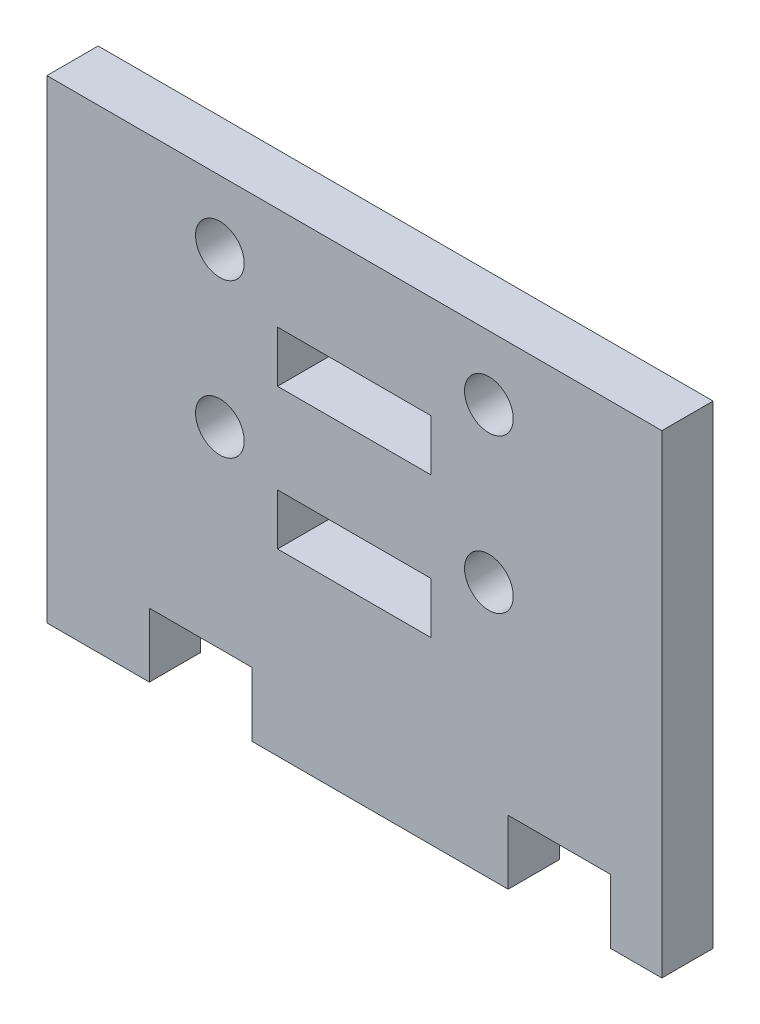
ISO-10303-21;
HEADER;
FILE_DESCRIPTION(('STEP AP214'),'2;1');
FILE_NAME('part.step','',(''),(''),'','','');
FILE_SCHEMA(('AUTOMOTIVE_DESIGN { 1 0 10303 214 1 1 1 1 }'));
ENDSEC;
DATA;
#1=APPLICATION_CONTEXT('core data for automotive mechanical design processes');
#2=APPLICATION_PROTOCOL_DEFINITION('international standard','automotive_design',2000,#1);
#3=PRODUCT_CONTEXT('',#1,'mechanical');
#4=PRODUCT('Part','Part','',(#3));
#5=PRODUCT_RELATED_PRODUCT_CATEGORY('part','',(#4));
#6=PRODUCT_DEFINITION_FORMATION('','',#4);
#7=PRODUCT_DEFINITION_CONTEXT('part definition',#1,'design');
#8=PRODUCT_DEFINITION('design','',#6,#7);
#9=PRODUCT_DEFINITION_SHAPE('','',#8);
#10=(LENGTH_UNIT() NAMED_UNIT(*) SI_UNIT(.MILLI.,.METRE.));
#11=(NAMED_UNIT(*) PLANE_ANGLE_UNIT() SI_UNIT($,.RADIAN.));
#12=(NAMED_UNIT(*) SI_UNIT($,.STERADIAN.) SOLID_ANGLE_UNIT());
#13=UNCERTAINTY_MEASURE_WITH_UNIT(LENGTH_MEASURE(1.E-05),#10,'distance_accuracy_value','');
#14=(GEOMETRIC_REPRESENTATION_CONTEXT(3) GLOBAL_UNCERTAINTY_ASSIGNED_CONTEXT((#13)) GLOBAL_UNIT_ASSIGNED_CONTEXT((#10,
#11,#12)) REPRESENTATION_CONTEXT('',''));
#15=CARTESIAN_POINT('',(0.,0.,0.));
#16=DIRECTION('',(0.,0.,1.));
#17=DIRECTION('',(1.,0.,0.));
#18=AXIS2_PLACEMENT_3D('',#15,#16,#17);
#19=CARTESIAN_POINT('',(0.,0.,2.));
#20=DIRECTION('',(0.,0.,-1.));
#21=DIRECTION('',(-1.,0.,0.));
#22=AXIS2_PLACEMENT_3D('',#19,#20,#21);
#23=PLANE('',#22);
#24=CARTESIAN_POINT('',(17.25,10.,2.));
#25=DIRECTION('',(0.,0.,1.));
#26=DIRECTION('',(-1.,0.,0.));
#27=AXIS2_PLACEMENT_3D('',#24,#25,#26);
#28=CIRCLE('',#27,0.950000000000001);
#29=CARTESIAN_POINT('',(16.3,10.,2.));
#30=VERTEX_POINT('',#29);
#31=EDGE_CURVE('E626',#30,#30,#28,.T.);
#32=ORIENTED_EDGE('',*,*,#31,.F.);
#33=EDGE_LOOP('',(#32));
#34=FACE_BOUND('',#33,.T.);
#35=DIRECTION('',(0.,-1.,0.));
#36=VECTOR('',#35,1.);
#37=CARTESIAN_POINT('',(9.00000000000001,9.,2.));
#38=LINE('',#37,#36);
#39=CARTESIAN_POINT('',(9.00000000000001,9.,2.));
#40=VERTEX_POINT('',#39);
#41=CARTESIAN_POINT('',(9.00000000000001,7.,2.));
#42=VERTEX_POINT('',#41);
#43=EDGE_CURVE('E169',#40,#42,#38,.T.);
#44=ORIENTED_EDGE('',*,*,#43,.F.);
#45=DIRECTION('',(-1.,0.,0.));
#46=VECTOR('',#45,1.);
#47=CARTESIAN_POINT('',(15.,9.,2.));
#48=LINE('',#47,#46);
#49=CARTESIAN_POINT('',(15.,9.,2.));
#50=VERTEX_POINT('',#49);
#51=EDGE_CURVE('E192',#50,#40,#48,.T.);
#52=ORIENTED_EDGE('',*,*,#51,.F.);
#53=DIRECTION('',(0.,1.,0.));
#54=VECTOR('',#53,1.);
#55=CARTESIAN_POINT('',(15.,7.,2.));
#56=LINE('',#55,#54);
#57=CARTESIAN_POINT('',(15.,7.,2.));
#58=VERTEX_POINT('',#57);
#59=EDGE_CURVE('E190',#58,#50,#56,.T.);
#60=ORIENTED_EDGE('',*,*,#59,.F.);
#61=DIRECTION('',(1.,0.,0.));
#62=VECTOR('',#61,1.);
#63=CARTESIAN_POINT('',(9.00000000000001,7.,2.));
#64=LINE('',#63,#62);
#65=EDGE_CURVE('E177',#42,#58,#64,.T.);
#66=ORIENTED_EDGE('',*,*,#65,.F.);
#67=EDGE_LOOP('',(#44,#52,#60,#66));
#68=FACE_BOUND('',#67,.T.);
#69=DIRECTION('',(1.,0.,0.));
#70=VECTOR('',#69,1.);
#71=CARTESIAN_POINT('',(9.00000000000001,12.5,2.));
#72=LINE('',#71,#70);
#73=CARTESIAN_POINT('',(9.00000000000001,12.5,2.));
#74=VERTEX_POINT('',#73);
#75=CARTESIAN_POINT('',(15.,12.5,2.));
#76=VERTEX_POINT('',#75);
#77=EDGE_CURVE('E214',#74,#76,#72,.T.);
#78=ORIENTED_EDGE('',*,*,#77,.F.);
#79=DIRECTION('',(0.,-1.,0.));
#80=VECTOR('',#79,1.);
#81=CARTESIAN_POINT('',(9.00000000000001,14.5,2.));
#82=LINE('',#81,#80);
#83=CARTESIAN_POINT('',(9.00000000000001,14.5,2.));
#84=VERTEX_POINT('',#83);
#85=EDGE_CURVE('E222',#84,#74,#82,.T.);
#86=ORIENTED_EDGE('',*,*,#85,.F.);
#87=DIRECTION('',(-1.,0.,0.));
#88=VECTOR('',#87,1.);
#89=CARTESIAN_POINT('',(15.,14.5,2.));
#90=LINE('',#89,#88);
#91=CARTESIAN_POINT('',(15.,14.5,2.));
#92=VERTEX_POINT('',#91);
#93=EDGE_CURVE('E219',#92,#84,#90,.T.);
#94=ORIENTED_EDGE('',*,*,#93,.F.);
#95=DIRECTION('',(0.,1.,0.));
#96=VECTOR('',#95,1.);
#97=CARTESIAN_POINT('',(15.,12.5,2.));
#98=LINE('',#97,#96);
#99=EDGE_CURVE('E216',#76,#92,#98,.T.);
#100=ORIENTED_EDGE('',*,*,#99,.F.);
#101=EDGE_LOOP('',(#78,#86,#94,#100));
#102=FACE_BOUND('',#101,.T.);
#103=DIRECTION('',(0.,-1.,0.));
#104=VECTOR('',#103,1.);
#105=CARTESIAN_POINT('',(0.,0.,2.));
#106=LINE('',#105,#104);
#107=CARTESIAN_POINT('',(0.,18.5,2.));
#108=VERTEX_POINT('',#107);
#109=CARTESIAN_POINT('',(0.,0.,2.));
#110=VERTEX_POINT('',#109);
#111=EDGE_CURVE('E245',#108,#110,#106,.T.);
#112=ORIENTED_EDGE('',*,*,#111,.T.);
#113=DIRECTION('',(1.,0.,0.));
#114=VECTOR('',#113,1.);
#115=CARTESIAN_POINT('',(4.,0.,2.));
#116=LINE('',#115,#114);
#117=CARTESIAN_POINT('',(4.,0.,2.));
#118=VERTEX_POINT('',#117);
#119=EDGE_CURVE('E248',#110,#118,#116,.T.);
#120=ORIENTED_EDGE('',*,*,#119,.T.);
#121=DIRECTION('',(0.,1.,0.));
#122=VECTOR('',#121,1.);
#123=CARTESIAN_POINT('',(4.,2.5,2.));
#124=LINE('',#123,#122);
#125=CARTESIAN_POINT('',(4.,2.5,2.));
#126=VERTEX_POINT('',#125);
#127=EDGE_CURVE('E251',#118,#126,#124,.T.);
#128=ORIENTED_EDGE('',*,*,#127,.T.);
#129=DIRECTION('',(1.,0.,0.));
#130=VECTOR('',#129,1.);
#131=CARTESIAN_POINT('',(4.,2.5,2.));
#132=LINE('',#131,#130);
#133=CARTESIAN_POINT('',(8.,2.5,2.));
#134=VERTEX_POINT('',#133);
#135=EDGE_CURVE('E253',#126,#134,#132,.T.);
#136=ORIENTED_EDGE('',*,*,#135,.T.);
#137=DIRECTION('',(0.,-1.,0.));
#138=VECTOR('',#137,1.);
#139=CARTESIAN_POINT('',(8.,0.,2.));
#140=LINE('',#139,#138);
#141=CARTESIAN_POINT('',(8.,0.,2.));
#142=VERTEX_POINT('',#141);
#143=EDGE_CURVE('E255',#134,#142,#140,.T.);
#144=ORIENTED_EDGE('',*,*,#143,.T.);
#145=DIRECTION('',(1.,0.,0.));
#146=VECTOR('',#145,1.);
#147=CARTESIAN_POINT('',(8.,0.,2.));
#148=LINE('',#147,#146);
#149=CARTESIAN_POINT('',(18.,0.,2.));
#150=VERTEX_POINT('',#149);
#151=EDGE_CURVE('E257',#142,#150,#148,.T.);
#152=ORIENTED_EDGE('',*,*,#151,.T.);
#153=DIRECTION('',(0.,1.,0.));
#154=VECTOR('',#153,1.);
#155=CARTESIAN_POINT('',(18.,0.,2.));
#156=LINE('',#155,#154);
#157=CARTESIAN_POINT('',(18.,2.5,2.));
#158=VERTEX_POINT('',#157);
#159=EDGE_CURVE('E259',#150,#158,#156,.T.);
#160=ORIENTED_EDGE('',*,*,#159,.T.);
#161=DIRECTION('',(1.,0.,0.));
#162=VECTOR('',#161,1.);
#163=CARTESIAN_POINT('',(18.,2.5,2.));
#164=LINE('',#163,#162);
#165=CARTESIAN_POINT('',(22.,2.5,2.));
#166=VERTEX_POINT('',#165);
#167=EDGE_CURVE('E261',#158,#166,#164,.T.);
#168=ORIENTED_EDGE('',*,*,#167,.T.);
#169=DIRECTION('',(0.,-1.,0.));
#170=VECTOR('',#169,1.);
#171=CARTESIAN_POINT('',(22.,2.5,2.));
#172=LINE('',#171,#170);
#173=CARTESIAN_POINT('',(22.,0.,2.));
#174=VERTEX_POINT('',#173);
#175=EDGE_CURVE('E263',#166,#174,#172,.T.);
#176=ORIENTED_EDGE('',*,*,#175,.T.);
#177=DIRECTION('',(1.,0.,0.));
#178=VECTOR('',#177,1.);
#179=CARTESIAN_POINT('',(22.,0.,2.));
#180=LINE('',#179,#178);
#181=CARTESIAN_POINT('',(24.,0.,2.));
#182=VERTEX_POINT('',#181);
#183=EDGE_CURVE('E265',#174,#182,#180,.T.);
#184=ORIENTED_EDGE('',*,*,#183,.T.);
#185=DIRECTION('',(0.,1.,0.));
#186=VECTOR('',#185,1.);
#187=CARTESIAN_POINT('',(24.,0.,2.));
#188=LINE('',#187,#186);
#189=CARTESIAN_POINT('',(24.,18.5,2.));
#190=VERTEX_POINT('',#189);
#191=EDGE_CURVE('E267',#182,#190,#188,.T.);
#192=ORIENTED_EDGE('',*,*,#191,.T.);
#193=DIRECTION('',(-1.,0.,0.));
#194=VECTOR('',#193,1.);
#195=CARTESIAN_POINT('',(0.,18.5,2.));
#196=LINE('',#195,#194);
#197=EDGE_CURVE('E269',#190,#108,#196,.T.);
#198=ORIENTED_EDGE('',*,*,#197,.T.);
#199=EDGE_LOOP('',(#112,#120,#128,#136,#144,#152,#160,#168,#176,#184,#192,#198));
#200=FACE_BOUND('',#199,.T.);
#201=CARTESIAN_POINT('',(6.75,16.,2.));
#202=DIRECTION('',(0.,0.,1.));
#203=DIRECTION('',(1.,0.,0.));
#204=AXIS2_PLACEMENT_3D('',#201,#202,#203);
#205=CIRCLE('',#204,0.95);
#206=CARTESIAN_POINT('',(7.7,16.,2.));
#207=VERTEX_POINT('',#206);
#208=EDGE_CURVE('E208',#207,#207,#205,.T.);
#209=ORIENTED_EDGE('',*,*,#208,.F.);
#210=EDGE_LOOP('',(#209));
#211=FACE_BOUND('',#210,.T.);
#212=CARTESIAN_POINT('',(6.75,9.99999999999999,2.));
#213=DIRECTION('',(0.,0.,1.));
#214=DIRECTION('',(1.,0.,0.));
#215=AXIS2_PLACEMENT_3D('',#212,#213,#214);
#216=CIRCLE('',#215,0.95);
#217=CARTESIAN_POINT('',(7.7,9.99999999999999,2.));
#218=VERTEX_POINT('',#217);
#219=EDGE_CURVE('E198',#218,#218,#216,.T.);
#220=ORIENTED_EDGE('',*,*,#219,.F.);
#221=EDGE_LOOP('',(#220));
#222=FACE_BOUND('',#221,.T.);
#223=CARTESIAN_POINT('',(17.25,16.,2.));
#224=DIRECTION('',(0.,0.,1.));
#225=DIRECTION('',(-1.,0.,0.));
#226=AXIS2_PLACEMENT_3D('',#223,#224,#225);
#227=CIRCLE('',#226,0.950000000000001);
#228=CARTESIAN_POINT('',(16.3,16.,2.));
#229=VERTEX_POINT('',#228);
#230=EDGE_CURVE('E617',#229,#229,#227,.T.);
#231=ORIENTED_EDGE('',*,*,#230,.F.);
#232=EDGE_LOOP('',(#231));
#233=FACE_BOUND('',#232,.T.);
#234=ADVANCED_FACE('F32',(#34,#68,#102,#200,#211,#222,#233),#23,.F.);
#235=CARTESIAN_POINT('',(0.,0.,0.));
#236=DIRECTION('',(0.,0.,-1.));
#237=DIRECTION('',(-1.,0.,0.));
#238=AXIS2_PLACEMENT_3D('',#235,#236,#237);
#239=PLANE('',#238);
#240=CARTESIAN_POINT('',(17.25,10.,0.));
#241=DIRECTION('',(0.,0.,1.));
#242=DIRECTION('',(-1.,0.,0.));
#243=AXIS2_PLACEMENT_3D('',#240,#241,#242);
#244=CIRCLE('',#243,0.950000000000001);
#245=CARTESIAN_POINT('',(16.3,10.,0.));
#246=VERTEX_POINT('',#245);
#247=EDGE_CURVE('E623',#246,#246,#244,.T.);
#248=ORIENTED_EDGE('',*,*,#247,.T.);
#249=EDGE_LOOP('',(#248));
#250=FACE_BOUND('',#249,.T.);
#251=DIRECTION('',(-1.,0.,0.));
#252=VECTOR('',#251,1.);
#253=CARTESIAN_POINT('',(15.,9.,0.));
#254=LINE('',#253,#252);
#255=CARTESIAN_POINT('',(15.,9.,0.));
#256=VERTEX_POINT('',#255);
#257=CARTESIAN_POINT('',(9.00000000000001,9.,0.));
#258=VERTEX_POINT('',#257);
#259=EDGE_CURVE('E178',#256,#258,#254,.T.);
#260=ORIENTED_EDGE('',*,*,#259,.T.);
#261=DIRECTION('',(0.,-1.,0.));
#262=VECTOR('',#261,1.);
#263=CARTESIAN_POINT('',(9.00000000000001,9.,0.));
#264=LINE('',#263,#262);
#265=CARTESIAN_POINT('',(9.00000000000001,7.,0.));
#266=VERTEX_POINT('',#265);
#267=EDGE_CURVE('E55',#258,#266,#264,.T.);
#268=ORIENTED_EDGE('',*,*,#267,.T.);
#269=DIRECTION('',(1.,0.,0.));
#270=VECTOR('',#269,1.);
#271=CARTESIAN_POINT('',(9.00000000000001,7.,0.));
#272=LINE('',#271,#270);
#273=CARTESIAN_POINT('',(15.,7.,0.));
#274=VERTEX_POINT('',#273);
#275=EDGE_CURVE('E184',#266,#274,#272,.T.);
#276=ORIENTED_EDGE('',*,*,#275,.T.);
#277=DIRECTION('',(0.,1.,0.));
#278=VECTOR('',#277,1.);
#279=CARTESIAN_POINT('',(15.,7.,0.));
#280=LINE('',#279,#278);
#281=EDGE_CURVE('E200',#274,#256,#280,.T.);
#282=ORIENTED_EDGE('',*,*,#281,.T.);
#283=EDGE_LOOP('',(#260,#268,#276,#282));
#284=FACE_BOUND('',#283,.T.);
#285=DIRECTION('',(0.,-1.,0.));
#286=VECTOR('',#285,1.);
#287=CARTESIAN_POINT('',(9.00000000000001,14.5,0.));
#288=LINE('',#287,#286);
#289=CARTESIAN_POINT('',(9.00000000000001,14.5,0.));
#290=VERTEX_POINT('',#289);
#291=CARTESIAN_POINT('',(9.00000000000001,12.5,0.));
#292=VERTEX_POINT('',#291);
#293=EDGE_CURVE('E217',#290,#292,#288,.T.);
#294=ORIENTED_EDGE('',*,*,#293,.T.);
#295=DIRECTION('',(1.,0.,0.));
#296=VECTOR('',#295,1.);
#297=CARTESIAN_POINT('',(9.00000000000001,12.5,0.));
#298=LINE('',#297,#296);
#299=CARTESIAN_POINT('',(15.,12.5,0.));
#300=VERTEX_POINT('',#299);
#301=EDGE_CURVE('E211',#292,#300,#298,.T.);
#302=ORIENTED_EDGE('',*,*,#301,.T.);
#303=DIRECTION('',(0.,1.,0.));
#304=VECTOR('',#303,1.);
#305=CARTESIAN_POINT('',(15.,12.5,0.));
#306=LINE('',#305,#304);
#307=CARTESIAN_POINT('',(15.,14.5,0.));
#308=VERTEX_POINT('',#307);
#309=EDGE_CURVE('E227',#300,#308,#306,.T.);
#310=ORIENTED_EDGE('',*,*,#309,.T.);
#311=DIRECTION('',(-1.,0.,0.));
#312=VECTOR('',#311,1.);
#313=CARTESIAN_POINT('',(15.,14.5,0.));
#314=LINE('',#313,#312);
#315=EDGE_CURVE('E230',#308,#290,#314,.T.);
#316=ORIENTED_EDGE('',*,*,#315,.T.);
#317=EDGE_LOOP('',(#294,#302,#310,#316));
#318=FACE_BOUND('',#317,.T.);
#319=DIRECTION('',(0.,-1.,0.));
#320=VECTOR('',#319,1.);
#321=CARTESIAN_POINT('',(0.,0.,0.));
#322=LINE('',#321,#320);
#323=CARTESIAN_POINT('',(0.,18.5,0.));
#324=VERTEX_POINT('',#323);
#325=CARTESIAN_POINT('',(0.,0.,0.));
#326=VERTEX_POINT('',#325);
#327=EDGE_CURVE('E244',#324,#326,#322,.T.);
#328=ORIENTED_EDGE('',*,*,#327,.F.);
#329=DIRECTION('',(-1.,0.,0.));
#330=VECTOR('',#329,1.);
#331=CARTESIAN_POINT('',(0.,18.5,0.));
#332=LINE('',#331,#330);
#333=CARTESIAN_POINT('',(24.,18.5,0.));
#334=VERTEX_POINT('',#333);
#335=EDGE_CURVE('E249',#334,#324,#332,.T.);
#336=ORIENTED_EDGE('',*,*,#335,.F.);
#337=DIRECTION('',(0.,1.,0.));
#338=VECTOR('',#337,1.);
#339=CARTESIAN_POINT('',(24.,0.,0.));
#340=LINE('',#339,#338);
#341=CARTESIAN_POINT('',(24.,0.,0.));
#342=VERTEX_POINT('',#341);
#343=EDGE_CURVE('E292',#342,#334,#340,.T.);
#344=ORIENTED_EDGE('',*,*,#343,.F.);
#345=DIRECTION('',(1.,0.,0.));
#346=VECTOR('',#345,1.);
#347=CARTESIAN_POINT('',(22.,0.,0.));
#348=LINE('',#347,#346);
#349=CARTESIAN_POINT('',(22.,0.,0.));
#350=VERTEX_POINT('',#349);
#351=EDGE_CURVE('E290',#350,#342,#348,.T.);
#352=ORIENTED_EDGE('',*,*,#351,.F.);
#353=DIRECTION('',(0.,-1.,0.));
#354=VECTOR('',#353,1.);
#355=CARTESIAN_POINT('',(22.,2.5,0.));
#356=LINE('',#355,#354);
#357=CARTESIAN_POINT('',(22.,2.5,0.));
#358=VERTEX_POINT('',#357);
#359=EDGE_CURVE('E288',#358,#350,#356,.T.);
#360=ORIENTED_EDGE('',*,*,#359,.F.);
#361=DIRECTION('',(1.,0.,0.));
#362=VECTOR('',#361,1.);
#363=CARTESIAN_POINT('',(18.,2.5,0.));
#364=LINE('',#363,#362);
#365=CARTESIAN_POINT('',(18.,2.5,0.));
#366=VERTEX_POINT('',#365);
#367=EDGE_CURVE('E286',#366,#358,#364,.T.);
#368=ORIENTED_EDGE('',*,*,#367,.F.);
#369=DIRECTION('',(0.,1.,0.));
#370=VECTOR('',#369,1.);
#371=CARTESIAN_POINT('',(18.,0.,0.));
#372=LINE('',#371,#370);
#373=CARTESIAN_POINT('',(18.,0.,0.));
#374=VERTEX_POINT('',#373);
#375=EDGE_CURVE('E284',#374,#366,#372,.T.);
#376=ORIENTED_EDGE('',*,*,#375,.F.);
#377=DIRECTION('',(1.,0.,0.));
#378=VECTOR('',#377,1.);
#379=CARTESIAN_POINT('',(8.,0.,0.));
#380=LINE('',#379,#378);
#381=CARTESIAN_POINT('',(8.,0.,0.));
#382=VERTEX_POINT('',#381);
#383=EDGE_CURVE('E282',#382,#374,#380,.T.);
#384=ORIENTED_EDGE('',*,*,#383,.F.);
#385=DIRECTION('',(0.,-1.,0.));
#386=VECTOR('',#385,1.);
#387=CARTESIAN_POINT('',(8.,0.,0.));
#388=LINE('',#387,#386);
#389=CARTESIAN_POINT('',(8.,2.5,0.));
#390=VERTEX_POINT('',#389);
#391=EDGE_CURVE('E280',#390,#382,#388,.T.);
#392=ORIENTED_EDGE('',*,*,#391,.F.);
#393=DIRECTION('',(1.,0.,0.));
#394=VECTOR('',#393,1.);
#395=CARTESIAN_POINT('',(4.,2.5,0.));
#396=LINE('',#395,#394);
#397=CARTESIAN_POINT('',(4.,2.5,0.));
#398=VERTEX_POINT('',#397);
#399=EDGE_CURVE('E278',#398,#390,#396,.T.);
#400=ORIENTED_EDGE('',*,*,#399,.F.);
#401=DIRECTION('',(0.,1.,0.));
#402=VECTOR('',#401,1.);
#403=CARTESIAN_POINT('',(4.,2.5,0.));
#404=LINE('',#403,#402);
#405=CARTESIAN_POINT('',(4.,0.,0.));
#406=VERTEX_POINT('',#405);
#407=EDGE_CURVE('E276',#406,#398,#404,.T.);
#408=ORIENTED_EDGE('',*,*,#407,.F.);
#409=DIRECTION('',(1.,0.,0.));
#410=VECTOR('',#409,1.);
#411=CARTESIAN_POINT('',(4.,0.,0.));
#412=LINE('',#411,#410);
#413=EDGE_CURVE('E274',#326,#406,#412,.T.);
#414=ORIENTED_EDGE('',*,*,#413,.F.);
#415=EDGE_LOOP('',(#328,#336,#344,#352,#360,#368,#376,#384,#392,#400,#408,#414));
#416=FACE_BOUND('',#415,.T.);
#417=CARTESIAN_POINT('',(6.75,16.,0.));
#418=DIRECTION('',(0.,0.,1.));
#419=DIRECTION('',(1.,0.,0.));
#420=AXIS2_PLACEMENT_3D('',#417,#418,#419);
#421=CIRCLE('',#420,0.95);
#422=CARTESIAN_POINT('',(7.7,16.,0.));
#423=VERTEX_POINT('',#422);
#424=EDGE_CURVE('E185',#423,#423,#421,.T.);
#425=ORIENTED_EDGE('',*,*,#424,.T.);
#426=EDGE_LOOP('',(#425));
#427=FACE_BOUND('',#426,.T.);
#428=CARTESIAN_POINT('',(6.75,9.99999999999999,0.));
#429=DIRECTION('',(0.,0.,1.));
#430=DIRECTION('',(1.,0.,0.));
#431=AXIS2_PLACEMENT_3D('',#428,#429,#430);
#432=CIRCLE('',#431,0.95);
#433=CARTESIAN_POINT('',(7.7,9.99999999999999,0.));
#434=VERTEX_POINT('',#433);
#435=EDGE_CURVE('E629',#434,#434,#432,.T.);
#436=ORIENTED_EDGE('',*,*,#435,.T.);
#437=EDGE_LOOP('',(#436));
#438=FACE_BOUND('',#437,.T.);
#439=CARTESIAN_POINT('',(17.25,16.,0.));
#440=DIRECTION('',(0.,0.,1.));
#441=DIRECTION('',(-1.,0.,0.));
#442=AXIS2_PLACEMENT_3D('',#439,#440,#441);
#443=CIRCLE('',#442,0.950000000000001);
#444=CARTESIAN_POINT('',(16.3,16.,0.));
#445=VERTEX_POINT('',#444);
#446=EDGE_CURVE('E620',#445,#445,#443,.T.);
#447=ORIENTED_EDGE('',*,*,#446,.T.);
#448=EDGE_LOOP('',(#447));
#449=FACE_BOUND('',#448,.T.);
#450=ADVANCED_FACE('F334',(#250,#284,#318,#416,#427,#438,#449),#239,.T.);
#451=CARTESIAN_POINT('',(0.,0.,2.));
#452=DIRECTION('',(1.,0.,0.));
#453=DIRECTION('',(0.,0.,-1.));
#454=AXIS2_PLACEMENT_3D('',#451,#452,#453);
#455=PLANE('',#454);
#456=ORIENTED_EDGE('',*,*,#327,.T.);
#457=DIRECTION('',(0.,0.,-1.));
#458=VECTOR('',#457,1.);
#459=CARTESIAN_POINT('',(0.,0.,2.));
#460=LINE('',#459,#458);
#461=EDGE_CURVE('E11',#110,#326,#460,.T.);
#462=ORIENTED_EDGE('',*,*,#461,.F.);
#463=ORIENTED_EDGE('',*,*,#111,.F.);
#464=DIRECTION('',(0.,0.,-1.));
#465=VECTOR('',#464,1.);
#466=CARTESIAN_POINT('',(0.,18.5,2.));
#467=LINE('',#466,#465);
#468=EDGE_CURVE('E271',#108,#324,#467,.T.);
#469=ORIENTED_EDGE('',*,*,#468,.T.);
#470=EDGE_LOOP('',(#456,#462,#463,#469));
#471=FACE_BOUND('',#470,.T.);
#472=ADVANCED_FACE('F34',(#471),#455,.F.);
#473=CARTESIAN_POINT('',(4.,0.,2.));
#474=DIRECTION('',(0.,1.,0.));
#475=DIRECTION('',(-1.,0.,0.));
#476=AXIS2_PLACEMENT_3D('',#473,#474,#475);
#477=PLANE('',#476);
#478=ORIENTED_EDGE('',*,*,#413,.T.);
#479=DIRECTION('',(0.,0.,-1.));
#480=VECTOR('',#479,1.);
#481=CARTESIAN_POINT('',(4.,0.,2.));
#482=LINE('',#481,#480);
#483=EDGE_CURVE('E40',#118,#406,#482,.T.);
#484=ORIENTED_EDGE('',*,*,#483,.F.);
#485=ORIENTED_EDGE('',*,*,#119,.F.);
#486=ORIENTED_EDGE('',*,*,#461,.T.);
#487=EDGE_LOOP('',(#478,#484,#485,#486));
#488=FACE_BOUND('',#487,.T.);
#489=ADVANCED_FACE('F352',(#488),#477,.F.);
#490=CARTESIAN_POINT('',(4.,2.5,2.));
#491=DIRECTION('',(-1.,0.,0.));
#492=DIRECTION('',(0.,-1.,0.));
#493=AXIS2_PLACEMENT_3D('',#490,#491,#492);
#494=PLANE('',#493);
#495=ORIENTED_EDGE('',*,*,#407,.T.);
#496=DIRECTION('',(0.,0.,-1.));
#497=VECTOR('',#496,1.);
#498=CARTESIAN_POINT('',(4.,2.5,2.));
#499=LINE('',#498,#497);
#500=EDGE_CURVE('E321',#126,#398,#499,.T.);
#501=ORIENTED_EDGE('',*,*,#500,.F.);
#502=ORIENTED_EDGE('',*,*,#127,.F.);
#503=ORIENTED_EDGE('',*,*,#483,.T.);
#504=EDGE_LOOP('',(#495,#501,#502,#503));
#505=FACE_BOUND('',#504,.T.);
#506=ADVANCED_FACE('F328',(#505),#494,.F.);
#507=CARTESIAN_POINT('',(4.,2.5,2.));
#508=DIRECTION('',(0.,1.,0.));
#509=DIRECTION('',(-1.,0.,0.));
#510=AXIS2_PLACEMENT_3D('',#507,#508,#509);
#511=PLANE('',#510);
#512=ORIENTED_EDGE('',*,*,#399,.T.);
#513=DIRECTION('',(0.,0.,-1.));
#514=VECTOR('',#513,1.);
#515=CARTESIAN_POINT('',(8.,2.5,2.));
#516=LINE('',#515,#514);
#517=EDGE_CURVE('E318',#134,#390,#516,.T.);
#518=ORIENTED_EDGE('',*,*,#517,.F.);
#519=ORIENTED_EDGE('',*,*,#135,.F.);
#520=ORIENTED_EDGE('',*,*,#500,.T.);
#521=EDGE_LOOP('',(#512,#518,#519,#520));
#522=FACE_BOUND('',#521,.T.);
#523=ADVANCED_FACE('F340',(#522),#511,.F.);
#524=CARTESIAN_POINT('',(8.,0.,2.));
#525=DIRECTION('',(1.,0.,0.));
#526=DIRECTION('',(0.,0.,-1.));
#527=AXIS2_PLACEMENT_3D('',#524,#525,#526);
#528=PLANE('',#527);
#529=ORIENTED_EDGE('',*,*,#391,.T.);
#530=DIRECTION('',(0.,0.,-1.));
#531=VECTOR('',#530,1.);
#532=CARTESIAN_POINT('',(8.,0.,2.));
#533=LINE('',#532,#531);
#534=EDGE_CURVE('E315',#142,#382,#533,.T.);
#535=ORIENTED_EDGE('',*,*,#534,.F.);
#536=ORIENTED_EDGE('',*,*,#143,.F.);
#537=ORIENTED_EDGE('',*,*,#517,.T.);
#538=EDGE_LOOP('',(#529,#535,#536,#537));
#539=FACE_BOUND('',#538,.T.);
#540=ADVANCED_FACE('F344',(#539),#528,.F.);
#541=CARTESIAN_POINT('',(8.,0.,2.));
#542=DIRECTION('',(0.,1.,0.));
#543=DIRECTION('',(-1.,0.,0.));
#544=AXIS2_PLACEMENT_3D('',#541,#542,#543);
#545=PLANE('',#544);
#546=ORIENTED_EDGE('',*,*,#383,.T.);
#547=DIRECTION('',(0.,0.,-1.));
#548=VECTOR('',#547,1.);
#549=CARTESIAN_POINT('',(18.,0.,2.));
#550=LINE('',#549,#548);
#551=EDGE_CURVE('E312',#150,#374,#550,.T.);
#552=ORIENTED_EDGE('',*,*,#551,.F.);
#553=ORIENTED_EDGE('',*,*,#151,.F.);
#554=ORIENTED_EDGE('',*,*,#534,.T.);
#555=EDGE_LOOP('',(#546,#552,#553,#554));
#556=FACE_BOUND('',#555,.T.);
#557=ADVANCED_FACE('F385',(#556),#545,.F.);
#558=CARTESIAN_POINT('',(18.,0.,2.));
#559=DIRECTION('',(-1.,0.,0.));
#560=DIRECTION('',(0.,0.,1.));
#561=AXIS2_PLACEMENT_3D('',#558,#559,#560);
#562=PLANE('',#561);
#563=ORIENTED_EDGE('',*,*,#375,.T.);
#564=DIRECTION('',(0.,0.,-1.));
#565=VECTOR('',#564,1.);
#566=CARTESIAN_POINT('',(18.,2.5,2.));
#567=LINE('',#566,#565);
#568=EDGE_CURVE('E309',#158,#366,#567,.T.);
#569=ORIENTED_EDGE('',*,*,#568,.F.);
#570=ORIENTED_EDGE('',*,*,#159,.F.);
#571=ORIENTED_EDGE('',*,*,#551,.T.);
#572=EDGE_LOOP('',(#563,#569,#570,#571));
#573=FACE_BOUND('',#572,.T.);
#574=ADVANCED_FACE('F383',(#573),#562,.F.);
#575=CARTESIAN_POINT('',(18.,2.5,2.));
#576=DIRECTION('',(0.,1.,0.));
#577=DIRECTION('',(-1.,0.,0.));
#578=AXIS2_PLACEMENT_3D('',#575,#576,#577);
#579=PLANE('',#578);
#580=ORIENTED_EDGE('',*,*,#367,.T.);
#581=DIRECTION('',(0.,0.,-1.));
#582=VECTOR('',#581,1.);
#583=CARTESIAN_POINT('',(22.,2.5,2.));
#584=LINE('',#583,#582);
#585=EDGE_CURVE('E306',#166,#358,#584,.T.);
#586=ORIENTED_EDGE('',*,*,#585,.F.);
#587=ORIENTED_EDGE('',*,*,#167,.F.);
#588=ORIENTED_EDGE('',*,*,#568,.T.);
#589=EDGE_LOOP('',(#580,#586,#587,#588));
#590=FACE_BOUND('',#589,.T.);
#591=ADVANCED_FACE('F379',(#590),#579,.F.);
#592=CARTESIAN_POINT('',(22.,2.5,2.));
#593=DIRECTION('',(1.,0.,0.));
#594=DIRECTION('',(0.,1.,0.));
#595=AXIS2_PLACEMENT_3D('',#592,#593,#594);
#596=PLANE('',#595);
#597=ORIENTED_EDGE('',*,*,#359,.T.);
#598=DIRECTION('',(0.,0.,-1.));
#599=VECTOR('',#598,1.);
#600=CARTESIAN_POINT('',(22.,0.,2.));
#601=LINE('',#600,#599);
#602=EDGE_CURVE('E303',#174,#350,#601,.T.);
#603=ORIENTED_EDGE('',*,*,#602,.F.);
#604=ORIENTED_EDGE('',*,*,#175,.F.);
#605=ORIENTED_EDGE('',*,*,#585,.T.);
#606=EDGE_LOOP('',(#597,#603,#604,#605));
#607=FACE_BOUND('',#606,.T.);
#608=ADVANCED_FACE('F374',(#607),#596,.F.);
#609=CARTESIAN_POINT('',(22.,0.,2.));
#610=DIRECTION('',(0.,1.,0.));
#611=DIRECTION('',(0.,0.,1.));
#612=AXIS2_PLACEMENT_3D('',#609,#610,#611);
#613=PLANE('',#612);
#614=ORIENTED_EDGE('',*,*,#351,.T.);
#615=DIRECTION('',(0.,0.,-1.));
#616=VECTOR('',#615,1.);
#617=CARTESIAN_POINT('',(24.,0.,2.));
#618=LINE('',#617,#616);
#619=EDGE_CURVE('E300',#182,#342,#618,.T.);
#620=ORIENTED_EDGE('',*,*,#619,.F.);
#621=ORIENTED_EDGE('',*,*,#183,.F.);
#622=ORIENTED_EDGE('',*,*,#602,.T.);
#623=EDGE_LOOP('',(#614,#620,#621,#622));
#624=FACE_BOUND('',#623,.T.);
#625=ADVANCED_FACE('F368',(#624),#613,.F.);
#626=CARTESIAN_POINT('',(24.,0.,2.));
#627=DIRECTION('',(-1.,0.,0.));
#628=DIRECTION('',(0.,0.,1.));
#629=AXIS2_PLACEMENT_3D('',#626,#627,#628);
#630=PLANE('',#629);
#631=ORIENTED_EDGE('',*,*,#343,.T.);
#632=DIRECTION('',(0.,0.,-1.));
#633=VECTOR('',#632,1.);
#634=CARTESIAN_POINT('',(24.,18.5,2.));
#635=LINE('',#634,#633);
#636=EDGE_CURVE('E297',#190,#334,#635,.T.);
#637=ORIENTED_EDGE('',*,*,#636,.F.);
#638=ORIENTED_EDGE('',*,*,#191,.F.);
#639=ORIENTED_EDGE('',*,*,#619,.T.);
#640=EDGE_LOOP('',(#631,#637,#638,#639));
#641=FACE_BOUND('',#640,.T.);
#642=ADVANCED_FACE('F364',(#641),#630,.F.);
#643=CARTESIAN_POINT('',(0.,18.5,2.));
#644=DIRECTION('',(0.,-1.,0.));
#645=DIRECTION('',(0.,0.,-1.));
#646=AXIS2_PLACEMENT_3D('',#643,#644,#645);
#647=PLANE('',#646);
#648=ORIENTED_EDGE('',*,*,#335,.T.);
#649=ORIENTED_EDGE('',*,*,#468,.F.);
#650=ORIENTED_EDGE('',*,*,#197,.F.);
#651=ORIENTED_EDGE('',*,*,#636,.T.);
#652=EDGE_LOOP('',(#648,#649,#650,#651));
#653=FACE_BOUND('',#652,.T.);
#654=ADVANCED_FACE('F359',(#653),#647,.F.);
#655=CARTESIAN_POINT('',(9.00000000000001,12.5,2.));
#656=DIRECTION('',(0.,1.,0.));
#657=DIRECTION('',(0.,0.,1.));
#658=AXIS2_PLACEMENT_3D('',#655,#656,#657);
#659=PLANE('',#658);
#660=ORIENTED_EDGE('',*,*,#301,.F.);
#661=DIRECTION('',(0.,0.,-1.));
#662=VECTOR('',#661,1.);
#663=CARTESIAN_POINT('',(9.00000000000001,12.5,2.));
#664=LINE('',#663,#662);
#665=EDGE_CURVE('E224',#74,#292,#664,.T.);
#666=ORIENTED_EDGE('',*,*,#665,.F.);
#667=ORIENTED_EDGE('',*,*,#77,.T.);
#668=DIRECTION('',(0.,0.,-1.));
#669=VECTOR('',#668,1.);
#670=CARTESIAN_POINT('',(15.,12.5,2.));
#671=LINE('',#670,#669);
#672=EDGE_CURVE('E241',#76,#300,#671,.T.);
#673=ORIENTED_EDGE('',*,*,#672,.T.);
#674=EDGE_LOOP('',(#660,#666,#667,#673));
#675=FACE_BOUND('',#674,.T.);
#676=ADVANCED_FACE('F404',(#675),#659,.T.);
#677=CARTESIAN_POINT('',(15.,12.5,2.));
#678=DIRECTION('',(-1.,0.,0.));
#679=DIRECTION('',(0.,0.,1.));
#680=AXIS2_PLACEMENT_3D('',#677,#678,#679);
#681=PLANE('',#680);
#682=ORIENTED_EDGE('',*,*,#309,.F.);
#683=ORIENTED_EDGE('',*,*,#672,.F.);
#684=ORIENTED_EDGE('',*,*,#99,.T.);
#685=DIRECTION('',(0.,0.,-1.));
#686=VECTOR('',#685,1.);
#687=CARTESIAN_POINT('',(15.,14.5,2.));
#688=LINE('',#687,#686);
#689=EDGE_CURVE('E239',#92,#308,#688,.T.);
#690=ORIENTED_EDGE('',*,*,#689,.T.);
#691=EDGE_LOOP('',(#682,#683,#684,#690));
#692=FACE_BOUND('',#691,.T.);
#693=ADVANCED_FACE('F442',(#692),#681,.T.);
#694=CARTESIAN_POINT('',(15.,14.5,2.));
#695=DIRECTION('',(0.,-1.,0.));
#696=DIRECTION('',(0.,0.,-1.));
#697=AXIS2_PLACEMENT_3D('',#694,#695,#696);
#698=PLANE('',#697);
#699=ORIENTED_EDGE('',*,*,#315,.F.);
#700=ORIENTED_EDGE('',*,*,#689,.F.);
#701=ORIENTED_EDGE('',*,*,#93,.T.);
#702=DIRECTION('',(0.,0.,-1.));
#703=VECTOR('',#702,1.);
#704=CARTESIAN_POINT('',(9.00000000000001,14.5,2.));
#705=LINE('',#704,#703);
#706=EDGE_CURVE('E237',#84,#290,#705,.T.);
#707=ORIENTED_EDGE('',*,*,#706,.T.);
#708=EDGE_LOOP('',(#699,#700,#701,#707));
#709=FACE_BOUND('',#708,.T.);
#710=ADVANCED_FACE('F449',(#709),#698,.T.);
#711=CARTESIAN_POINT('',(9.00000000000001,14.5,2.));
#712=DIRECTION('',(1.,0.,0.));
#713=DIRECTION('',(0.,0.,-1.));
#714=AXIS2_PLACEMENT_3D('',#711,#712,#713);
#715=PLANE('',#714);
#716=ORIENTED_EDGE('',*,*,#293,.F.);
#717=ORIENTED_EDGE('',*,*,#706,.F.);
#718=ORIENTED_EDGE('',*,*,#85,.T.);
#719=ORIENTED_EDGE('',*,*,#665,.T.);
#720=EDGE_LOOP('',(#716,#717,#718,#719));
#721=FACE_BOUND('',#720,.T.);
#722=ADVANCED_FACE('F456',(#721),#715,.T.);
#723=CARTESIAN_POINT('',(6.75,16.,2.));
#724=DIRECTION('',(0.,0.,-1.));
#725=DIRECTION('',(-1.,0.,0.));
#726=AXIS2_PLACEMENT_3D('',#723,#724,#725);
#727=CYLINDRICAL_SURFACE('',#726,0.95);
#728=ORIENTED_EDGE('',*,*,#208,.T.);
#729=EDGE_LOOP('',(#728));
#730=FACE_BOUND('',#729,.T.);
#731=ORIENTED_EDGE('',*,*,#424,.F.);
#732=EDGE_LOOP('',(#731));
#733=FACE_BOUND('',#732,.T.);
#734=ADVANCED_FACE('F464',(#730,#733),#727,.F.);
#735=CARTESIAN_POINT('',(9.00000000000001,9.,2.));
#736=DIRECTION('',(1.,0.,0.));
#737=DIRECTION('',(0.,0.,-1.));
#738=AXIS2_PLACEMENT_3D('',#735,#736,#737);
#739=PLANE('',#738);
#740=ORIENTED_EDGE('',*,*,#267,.F.);
#741=DIRECTION('',(0.,0.,-1.));
#742=VECTOR('',#741,1.);
#743=CARTESIAN_POINT('',(9.00000000000001,9.,2.));
#744=LINE('',#743,#742);
#745=EDGE_CURVE('E173',#40,#258,#744,.T.);
#746=ORIENTED_EDGE('',*,*,#745,.F.);
#747=ORIENTED_EDGE('',*,*,#43,.T.);
#748=DIRECTION('',(0.,0.,-1.));
#749=VECTOR('',#748,1.);
#750=CARTESIAN_POINT('',(9.00000000000001,7.,2.));
#751=LINE('',#750,#749);
#752=EDGE_CURVE('E172',#42,#266,#751,.T.);
#753=ORIENTED_EDGE('',*,*,#752,.T.);
#754=EDGE_LOOP('',(#740,#746,#747,#753));
#755=FACE_BOUND('',#754,.T.);
#756=ADVANCED_FACE('F171',(#755),#739,.T.);
#757=CARTESIAN_POINT('',(9.00000000000001,7.,2.));
#758=DIRECTION('',(0.,1.,0.));
#759=DIRECTION('',(0.,0.,1.));
#760=AXIS2_PLACEMENT_3D('',#757,#758,#759);
#761=PLANE('',#760);
#762=ORIENTED_EDGE('',*,*,#275,.F.);
#763=ORIENTED_EDGE('',*,*,#752,.F.);
#764=ORIENTED_EDGE('',*,*,#65,.T.);
#765=DIRECTION('',(0.,0.,-1.));
#766=VECTOR('',#765,1.);
#767=CARTESIAN_POINT('',(15.,7.,2.));
#768=LINE('',#767,#766);
#769=EDGE_CURVE('E186',#58,#274,#768,.T.);
#770=ORIENTED_EDGE('',*,*,#769,.T.);
#771=EDGE_LOOP('',(#762,#763,#764,#770));
#772=FACE_BOUND('',#771,.T.);
#773=ADVANCED_FACE('F181',(#772),#761,.T.);
#774=CARTESIAN_POINT('',(15.,7.,2.));
#775=DIRECTION('',(-1.,0.,0.));
#776=DIRECTION('',(0.,0.,1.));
#777=AXIS2_PLACEMENT_3D('',#774,#775,#776);
#778=PLANE('',#777);
#779=ORIENTED_EDGE('',*,*,#281,.F.);
#780=ORIENTED_EDGE('',*,*,#769,.F.);
#781=ORIENTED_EDGE('',*,*,#59,.T.);
#782=DIRECTION('',(0.,0.,-1.));
#783=VECTOR('',#782,1.);
#784=CARTESIAN_POINT('',(15.,9.,2.));
#785=LINE('',#784,#783);
#786=EDGE_CURVE('E47',#50,#256,#785,.T.);
#787=ORIENTED_EDGE('',*,*,#786,.T.);
#788=EDGE_LOOP('',(#779,#780,#781,#787));
#789=FACE_BOUND('',#788,.T.);
#790=ADVANCED_FACE('F485',(#789),#778,.T.);
#791=CARTESIAN_POINT('',(15.,9.,2.));
#792=DIRECTION('',(0.,-1.,0.));
#793=DIRECTION('',(0.,0.,-1.));
#794=AXIS2_PLACEMENT_3D('',#791,#792,#793);
#795=PLANE('',#794);
#796=ORIENTED_EDGE('',*,*,#259,.F.);
#797=ORIENTED_EDGE('',*,*,#786,.F.);
#798=ORIENTED_EDGE('',*,*,#51,.T.);
#799=ORIENTED_EDGE('',*,*,#745,.T.);
#800=EDGE_LOOP('',(#796,#797,#798,#799));
#801=FACE_BOUND('',#800,.T.);
#802=ADVANCED_FACE('F492',(#801),#795,.T.);
#803=CARTESIAN_POINT('',(6.75,9.99999999999999,2.));
#804=DIRECTION('',(0.,0.,-1.));
#805=DIRECTION('',(-1.,0.,0.));
#806=AXIS2_PLACEMENT_3D('',#803,#804,#805);
#807=CYLINDRICAL_SURFACE('',#806,0.95);
#808=ORIENTED_EDGE('',*,*,#219,.T.);
#809=EDGE_LOOP('',(#808));
#810=FACE_BOUND('',#809,.T.);
#811=ORIENTED_EDGE('',*,*,#435,.F.);
#812=EDGE_LOOP('',(#811));
#813=FACE_BOUND('',#812,.T.);
#814=ADVANCED_FACE('F500',(#810,#813),#807,.F.);
#815=CARTESIAN_POINT('',(17.25,10.,2.));
#816=DIRECTION('',(0.,0.,-1.));
#817=DIRECTION('',(-1.,0.,0.));
#818=AXIS2_PLACEMENT_3D('',#815,#816,#817);
#819=CYLINDRICAL_SURFACE('',#818,0.950000000000001);
#820=ORIENTED_EDGE('',*,*,#31,.T.);
#821=EDGE_LOOP('',(#820));
#822=FACE_BOUND('',#821,.T.);
#823=ORIENTED_EDGE('',*,*,#247,.F.);
#824=EDGE_LOOP('',(#823));
#825=FACE_BOUND('',#824,.T.);
#826=ADVANCED_FACE('F507',(#822,#825),#819,.F.);
#827=CARTESIAN_POINT('',(17.25,16.,2.));
#828=DIRECTION('',(0.,0.,-1.));
#829=DIRECTION('',(-1.,0.,0.));
#830=AXIS2_PLACEMENT_3D('',#827,#828,#829);
#831=CYLINDRICAL_SURFACE('',#830,0.950000000000001);
#832=ORIENTED_EDGE('',*,*,#230,.T.);
#833=EDGE_LOOP('',(#832));
#834=FACE_BOUND('',#833,.T.);
#835=ORIENTED_EDGE('',*,*,#446,.F.);
#836=EDGE_LOOP('',(#835));
#837=FACE_BOUND('',#836,.T.);
#838=ADVANCED_FACE('F515',(#834,#837),#831,.F.);
#839=CLOSED_SHELL('',(#234,#450,#472,#489,#506,#523,#540,#557,#574,#591,#608,#625,#642,#654,
#676,#693,#710,#722,#734,#756,#773,#790,#802,#814,#826,#838));
#840=MANIFOLD_SOLID_BREP('B2',#839);
#841=ADVANCED_BREP_SHAPE_REPRESENTATION('',(#18,#840),#14);
#842=SHAPE_DEFINITION_REPRESENTATION(#9,#841);
ENDSEC;
END-ISO-10303-21;
